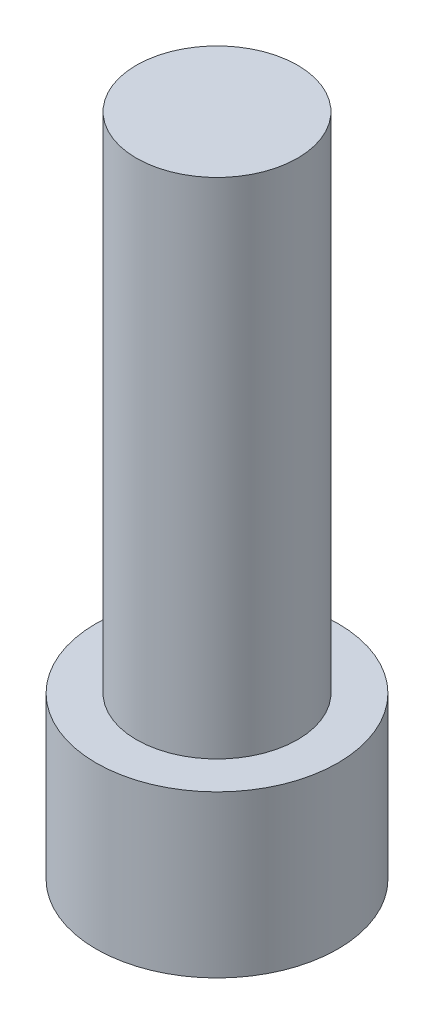
ISO-10303-21;
HEADER;
FILE_DESCRIPTION(('STEP AP214'),'2;1');
FILE_NAME('part.step','',(''),(''),'','','');
FILE_SCHEMA(('AUTOMOTIVE_DESIGN { 1 0 10303 214 1 1 1 1 }'));
ENDSEC;
DATA;
#1=APPLICATION_CONTEXT('core data for automotive mechanical design processes');
#2=APPLICATION_PROTOCOL_DEFINITION('international standard','automotive_design',2000,#1);
#3=PRODUCT_CONTEXT('',#1,'mechanical');
#4=PRODUCT('Part','Part','',(#3));
#5=PRODUCT_RELATED_PRODUCT_CATEGORY('part','',(#4));
#6=PRODUCT_DEFINITION_FORMATION('','',#4);
#7=PRODUCT_DEFINITION_CONTEXT('part definition',#1,'design');
#8=PRODUCT_DEFINITION('design','',#6,#7);
#9=PRODUCT_DEFINITION_SHAPE('','',#8);
#10=(LENGTH_UNIT() NAMED_UNIT(*) SI_UNIT(.MILLI.,.METRE.));
#11=(NAMED_UNIT(*) PLANE_ANGLE_UNIT() SI_UNIT($,.RADIAN.));
#12=(NAMED_UNIT(*) SI_UNIT($,.STERADIAN.) SOLID_ANGLE_UNIT());
#13=UNCERTAINTY_MEASURE_WITH_UNIT(LENGTH_MEASURE(1.E-05),#10,'distance_accuracy_value','');
#14=(GEOMETRIC_REPRESENTATION_CONTEXT(3) GLOBAL_UNCERTAINTY_ASSIGNED_CONTEXT((#13)) GLOBAL_UNIT_ASSIGNED_CONTEXT((#10,
#11,#12)) REPRESENTATION_CONTEXT('',''));
#15=CARTESIAN_POINT('',(0.,0.,0.));
#16=DIRECTION('',(0.,0.,1.));
#17=DIRECTION('',(1.,0.,0.));
#18=AXIS2_PLACEMENT_3D('',#15,#16,#17);
#19=CARTESIAN_POINT('',(0.,25.,0.));
#20=DIRECTION('',(0.,-1.,0.));
#21=DIRECTION('',(0.,0.,-1.));
#22=AXIS2_PLACEMENT_3D('',#19,#20,#21);
#23=CYLINDRICAL_SURFACE('',#22,4.);
#24=CARTESIAN_POINT('',(0.,25.,0.));
#25=DIRECTION('',(0.,1.,0.));
#26=DIRECTION('',(0.,0.,1.));
#27=AXIS2_PLACEMENT_3D('',#24,#25,#26);
#28=CIRCLE('',#27,4.);
#29=CARTESIAN_POINT('',(0.,25.,4.));
#30=VERTEX_POINT('',#29);
#31=EDGE_CURVE('E12',#30,#30,#28,.T.);
#32=ORIENTED_EDGE('',*,*,#31,.F.);
#33=EDGE_LOOP('',(#32));
#34=FACE_BOUND('',#33,.T.);
#35=CARTESIAN_POINT('',(0.,0.,0.));
#36=DIRECTION('',(0.,1.,0.));
#37=DIRECTION('',(0.,0.,1.));
#38=AXIS2_PLACEMENT_3D('',#35,#36,#37);
#39=CIRCLE('',#38,4.);
#40=CARTESIAN_POINT('',(0.,0.,4.));
#41=VERTEX_POINT('',#40);
#42=EDGE_CURVE('E66',#41,#41,#39,.T.);
#43=ORIENTED_EDGE('',*,*,#42,.T.);
#44=EDGE_LOOP('',(#43));
#45=FACE_BOUND('',#44,.T.);
#46=ADVANCED_FACE('F63',(#34,#45),#23,.T.);
#47=CARTESIAN_POINT('',(0.,25.,0.));
#48=DIRECTION('',(0.,1.,0.));
#49=DIRECTION('',(0.,0.,1.));
#50=AXIS2_PLACEMENT_3D('',#47,#48,#49);
#51=PLANE('',#50);
#52=ORIENTED_EDGE('',*,*,#31,.T.);
#53=EDGE_LOOP('',(#52));
#54=FACE_BOUND('',#53,.T.);
#55=ADVANCED_FACE('F202',(#54),#51,.T.);
#56=CARTESIAN_POINT('',(0.,0.,0.));
#57=DIRECTION('',(0.,-1.,0.));
#58=DIRECTION('',(0.,0.,-1.));
#59=AXIS2_PLACEMENT_3D('',#56,#57,#58);
#60=PLANE('',#59);
#61=ORIENTED_EDGE('',*,*,#42,.F.);
#62=EDGE_LOOP('',(#61));
#63=FACE_BOUND('',#62,.T.);
#64=CARTESIAN_POINT('',(0.,0.,0.));
#65=DIRECTION('',(0.,-1.,0.));
#66=DIRECTION('',(0.,0.,-1.));
#67=AXIS2_PLACEMENT_3D('',#64,#65,#66);
#68=CIRCLE('',#67,6.);
#69=CARTESIAN_POINT('',(0.,0.,-6.));
#70=VERTEX_POINT('',#69);
#71=EDGE_CURVE('E188',#70,#70,#68,.T.);
#72=ORIENTED_EDGE('',*,*,#71,.F.);
#73=EDGE_LOOP('',(#72));
#74=FACE_BOUND('',#73,.T.);
#75=ADVANCED_FACE('F198',(#63,#74),#60,.F.);
#76=CARTESIAN_POINT('',(0.,-2.,0.));
#77=DIRECTION('',(0.,1.,0.));
#78=DIRECTION('',(0.,0.,1.));
#79=AXIS2_PLACEMENT_3D('',#76,#77,#78);
#80=CYLINDRICAL_SURFACE('',#79,6.);
#81=ORIENTED_EDGE('',*,*,#71,.T.);
#82=EDGE_LOOP('',(#81));
#83=FACE_BOUND('',#82,.T.);
#84=CARTESIAN_POINT('',(0.,-8.,0.));
#85=DIRECTION('',(0.,-1.,0.));
#86=DIRECTION('',(0.,0.,-1.));
#87=AXIS2_PLACEMENT_3D('',#84,#85,#86);
#88=CIRCLE('',#87,6.);
#89=CARTESIAN_POINT('',(0.,-8.,-6.));
#90=VERTEX_POINT('',#89);
#91=EDGE_CURVE('E132',#90,#90,#88,.T.);
#92=ORIENTED_EDGE('',*,*,#91,.F.);
#93=EDGE_LOOP('',(#92));
#94=FACE_BOUND('',#93,.T.);
#95=ADVANCED_FACE('F201',(#83,#94),#80,.T.);
#96=CARTESIAN_POINT('',(0.,-8.,0.));
#97=DIRECTION('',(0.,-1.,0.));
#98=DIRECTION('',(0.,0.,-1.));
#99=AXIS2_PLACEMENT_3D('',#96,#97,#98);
#100=PLANE('',#99);
#101=ORIENTED_EDGE('',*,*,#91,.T.);
#102=EDGE_LOOP('',(#101));
#103=FACE_BOUND('',#102,.T.);
#104=DIRECTION('',(-0.5,0.,0.866025403784438));
#105=VECTOR('',#104,1.);
#106=CARTESIAN_POINT('',(4.61880215351701,-8.,0.));
#107=LINE('',#106,#105);
#108=CARTESIAN_POINT('',(4.61880215351701,-8.,0.));
#109=VERTEX_POINT('',#108);
#110=CARTESIAN_POINT('',(2.3094010767585,-8.,4.));
#111=VERTEX_POINT('',#110);
#112=EDGE_CURVE('E125',#109,#111,#107,.T.);
#113=ORIENTED_EDGE('',*,*,#112,.F.);
#114=DIRECTION('',(0.5,0.,0.866025403784438));
#115=VECTOR('',#114,1.);
#116=CARTESIAN_POINT('',(2.3094010767585,-8.,-4.));
#117=LINE('',#116,#115);
#118=CARTESIAN_POINT('',(2.3094010767585,-8.,-4.));
#119=VERTEX_POINT('',#118);
#120=EDGE_CURVE('E115',#119,#109,#117,.T.);
#121=ORIENTED_EDGE('',*,*,#120,.F.);
#122=DIRECTION('',(1.,0.,0.));
#123=VECTOR('',#122,1.);
#124=CARTESIAN_POINT('',(-2.3094010767585,-8.,-4.));
#125=LINE('',#124,#123);
#126=CARTESIAN_POINT('',(-2.3094010767585,-8.,-4.));
#127=VERTEX_POINT('',#126);
#128=EDGE_CURVE('E151',#127,#119,#125,.T.);
#129=ORIENTED_EDGE('',*,*,#128,.F.);
#130=DIRECTION('',(0.5,0.,-0.866025403784439));
#131=VECTOR('',#130,1.);
#132=CARTESIAN_POINT('',(-4.61880215351701,-8.,0.));
#133=LINE('',#132,#131);
#134=CARTESIAN_POINT('',(-4.61880215351701,-8.,0.));
#135=VERTEX_POINT('',#134);
#136=EDGE_CURVE('E147',#135,#127,#133,.T.);
#137=ORIENTED_EDGE('',*,*,#136,.F.);
#138=DIRECTION('',(-0.5,0.,-0.866025403784438));
#139=VECTOR('',#138,1.);
#140=CARTESIAN_POINT('',(-2.3094010767585,-8.,4.));
#141=LINE('',#140,#139);
#142=CARTESIAN_POINT('',(-2.3094010767585,-8.,4.));
#143=VERTEX_POINT('',#142);
#144=EDGE_CURVE('E142',#143,#135,#141,.T.);
#145=ORIENTED_EDGE('',*,*,#144,.F.);
#146=DIRECTION('',(-1.,0.,0.));
#147=VECTOR('',#146,1.);
#148=CARTESIAN_POINT('',(2.3094010767585,-8.,4.));
#149=LINE('',#148,#147);
#150=EDGE_CURVE('E138',#111,#143,#149,.T.);
#151=ORIENTED_EDGE('',*,*,#150,.F.);
#152=EDGE_LOOP('',(#113,#121,#129,#137,#145,#151));
#153=FACE_BOUND('',#152,.T.);
#154=ADVANCED_FACE('F136',(#103,#153),#100,.T.);
#155=CARTESIAN_POINT('',(2.3094010767585,-8.,-4.));
#156=DIRECTION('',(-0.866025403784439,0.,0.5));
#157=DIRECTION('',(0.5,0.,0.866025403784439));
#158=AXIS2_PLACEMENT_3D('',#155,#156,#157);
#159=PLANE('',#158);
#160=DIRECTION('',(0.5,0.,0.866025403784438));
#161=VECTOR('',#160,1.);
#162=CARTESIAN_POINT('',(2.3094010767585,-2.,-4.));
#163=LINE('',#162,#161);
#164=CARTESIAN_POINT('',(2.3094010767585,-2.,-4.));
#165=VERTEX_POINT('',#164);
#166=CARTESIAN_POINT('',(4.61880215351701,-2.,0.));
#167=VERTEX_POINT('',#166);
#168=EDGE_CURVE('E78',#165,#167,#163,.T.);
#169=ORIENTED_EDGE('',*,*,#168,.F.);
#170=DIRECTION('',(0.,1.,0.));
#171=VECTOR('',#170,1.);
#172=CARTESIAN_POINT('',(2.3094010767585,-8.,-4.));
#173=LINE('',#172,#171);
#174=EDGE_CURVE('E120',#119,#165,#173,.T.);
#175=ORIENTED_EDGE('',*,*,#174,.F.);
#176=ORIENTED_EDGE('',*,*,#120,.T.);
#177=DIRECTION('',(0.,1.,0.));
#178=VECTOR('',#177,1.);
#179=CARTESIAN_POINT('',(4.61880215351701,-8.,0.));
#180=LINE('',#179,#178);
#181=EDGE_CURVE('E118',#109,#167,#180,.T.);
#182=ORIENTED_EDGE('',*,*,#181,.T.);
#183=EDGE_LOOP('',(#169,#175,#176,#182));
#184=FACE_BOUND('',#183,.T.);
#185=ADVANCED_FACE('F117',(#184),#159,.T.);
#186=CARTESIAN_POINT('',(4.61880215351701,-8.,0.));
#187=DIRECTION('',(-0.866025403784438,0.,-0.5));
#188=DIRECTION('',(-0.5,0.,0.866025403784439));
#189=AXIS2_PLACEMENT_3D('',#186,#187,#188);
#190=PLANE('',#189);
#191=DIRECTION('',(-0.5,0.,0.866025403784438));
#192=VECTOR('',#191,1.);
#193=CARTESIAN_POINT('',(4.61880215351701,-2.,0.));
#194=LINE('',#193,#192);
#195=CARTESIAN_POINT('',(2.3094010767585,-2.,4.));
#196=VERTEX_POINT('',#195);
#197=EDGE_CURVE('E82',#167,#196,#194,.T.);
#198=ORIENTED_EDGE('',*,*,#197,.F.);
#199=ORIENTED_EDGE('',*,*,#181,.F.);
#200=ORIENTED_EDGE('',*,*,#112,.T.);
#201=DIRECTION('',(0.,1.,0.));
#202=VECTOR('',#201,1.);
#203=CARTESIAN_POINT('',(2.3094010767585,-8.,4.));
#204=LINE('',#203,#202);
#205=EDGE_CURVE('E133',#111,#196,#204,.T.);
#206=ORIENTED_EDGE('',*,*,#205,.T.);
#207=EDGE_LOOP('',(#198,#199,#200,#206));
#208=FACE_BOUND('',#207,.T.);
#209=ADVANCED_FACE('F129',(#208),#190,.T.);
#210=CARTESIAN_POINT('',(2.3094010767585,-8.,4.));
#211=DIRECTION('',(0.,0.,-1.));
#212=DIRECTION('',(-1.,0.,0.));
#213=AXIS2_PLACEMENT_3D('',#210,#211,#212);
#214=PLANE('',#213);
#215=DIRECTION('',(-1.,0.,0.));
#216=VECTOR('',#215,1.);
#217=CARTESIAN_POINT('',(2.3094010767585,-2.,4.));
#218=LINE('',#217,#216);
#219=CARTESIAN_POINT('',(-2.3094010767585,-2.,4.));
#220=VERTEX_POINT('',#219);
#221=EDGE_CURVE('E158',#196,#220,#218,.T.);
#222=ORIENTED_EDGE('',*,*,#221,.F.);
#223=ORIENTED_EDGE('',*,*,#205,.F.);
#224=ORIENTED_EDGE('',*,*,#150,.T.);
#225=DIRECTION('',(0.,1.,0.));
#226=VECTOR('',#225,1.);
#227=CARTESIAN_POINT('',(-2.3094010767585,-8.,4.));
#228=LINE('',#227,#226);
#229=EDGE_CURVE('E179',#143,#220,#228,.T.);
#230=ORIENTED_EDGE('',*,*,#229,.T.);
#231=EDGE_LOOP('',(#222,#223,#224,#230));
#232=FACE_BOUND('',#231,.T.);
#233=ADVANCED_FACE('F264',(#232),#214,.T.);
#234=CARTESIAN_POINT('',(-2.3094010767585,-8.,4.));
#235=DIRECTION('',(0.866025403784439,0.,-0.5));
#236=DIRECTION('',(-0.5,0.,-0.866025403784439));
#237=AXIS2_PLACEMENT_3D('',#234,#235,#236);
#238=PLANE('',#237);
#239=DIRECTION('',(-0.5,0.,-0.866025403784438));
#240=VECTOR('',#239,1.);
#241=CARTESIAN_POINT('',(-2.3094010767585,-2.,4.));
#242=LINE('',#241,#240);
#243=CARTESIAN_POINT('',(-4.61880215351701,-2.,0.));
#244=VERTEX_POINT('',#243);
#245=EDGE_CURVE('E161',#220,#244,#242,.T.);
#246=ORIENTED_EDGE('',*,*,#245,.F.);
#247=ORIENTED_EDGE('',*,*,#229,.F.);
#248=ORIENTED_EDGE('',*,*,#144,.T.);
#249=DIRECTION('',(0.,1.,0.));
#250=VECTOR('',#249,1.);
#251=CARTESIAN_POINT('',(-4.61880215351701,-8.,0.));
#252=LINE('',#251,#250);
#253=EDGE_CURVE('E175',#135,#244,#252,.T.);
#254=ORIENTED_EDGE('',*,*,#253,.T.);
#255=EDGE_LOOP('',(#246,#247,#248,#254));
#256=FACE_BOUND('',#255,.T.);
#257=ADVANCED_FACE('F274',(#256),#238,.T.);
#258=CARTESIAN_POINT('',(-4.61880215351701,-8.,0.));
#259=DIRECTION('',(0.866025403784439,0.,0.5));
#260=DIRECTION('',(0.5,0.,-0.866025403784439));
#261=AXIS2_PLACEMENT_3D('',#258,#259,#260);
#262=PLANE('',#261);
#263=DIRECTION('',(0.5,0.,-0.866025403784439));
#264=VECTOR('',#263,1.);
#265=CARTESIAN_POINT('',(-4.61880215351701,-2.,0.));
#266=LINE('',#265,#264);
#267=CARTESIAN_POINT('',(-2.3094010767585,-2.,-4.));
#268=VERTEX_POINT('',#267);
#269=EDGE_CURVE('E164',#244,#268,#266,.T.);
#270=ORIENTED_EDGE('',*,*,#269,.F.);
#271=ORIENTED_EDGE('',*,*,#253,.F.);
#272=ORIENTED_EDGE('',*,*,#136,.T.);
#273=DIRECTION('',(0.,1.,0.));
#274=VECTOR('',#273,1.);
#275=CARTESIAN_POINT('',(-2.3094010767585,-8.,-4.));
#276=LINE('',#275,#274);
#277=EDGE_CURVE('E171',#127,#268,#276,.T.);
#278=ORIENTED_EDGE('',*,*,#277,.T.);
#279=EDGE_LOOP('',(#270,#271,#272,#278));
#280=FACE_BOUND('',#279,.T.);
#281=ADVANCED_FACE('F285',(#280),#262,.T.);
#282=CARTESIAN_POINT('',(-2.3094010767585,-8.,-4.));
#283=DIRECTION('',(0.,0.,1.));
#284=DIRECTION('',(1.,0.,0.));
#285=AXIS2_PLACEMENT_3D('',#282,#283,#284);
#286=PLANE('',#285);
#287=DIRECTION('',(1.,0.,0.));
#288=VECTOR('',#287,1.);
#289=CARTESIAN_POINT('',(-2.3094010767585,-2.,-4.));
#290=LINE('',#289,#288);
#291=EDGE_CURVE('E126',#268,#165,#290,.T.);
#292=ORIENTED_EDGE('',*,*,#291,.F.);
#293=ORIENTED_EDGE('',*,*,#277,.F.);
#294=ORIENTED_EDGE('',*,*,#128,.T.);
#295=ORIENTED_EDGE('',*,*,#174,.T.);
#296=EDGE_LOOP('',(#292,#293,#294,#295));
#297=FACE_BOUND('',#296,.T.);
#298=ADVANCED_FACE('F296',(#297),#286,.T.);
#299=CARTESIAN_POINT('',(0.,-2.,0.));
#300=DIRECTION('',(0.,-1.,0.));
#301=DIRECTION('',(0.,0.,-1.));
#302=AXIS2_PLACEMENT_3D('',#299,#300,#301);
#303=PLANE('',#302);
#304=ORIENTED_EDGE('',*,*,#168,.T.);
#305=ORIENTED_EDGE('',*,*,#197,.T.);
#306=ORIENTED_EDGE('',*,*,#221,.T.);
#307=ORIENTED_EDGE('',*,*,#245,.T.);
#308=ORIENTED_EDGE('',*,*,#269,.T.);
#309=ORIENTED_EDGE('',*,*,#291,.T.);
#310=EDGE_LOOP('',(#304,#305,#306,#307,#308,#309));
#311=FACE_BOUND('',#310,.T.);
#312=ADVANCED_FACE('F307',(#311),#303,.T.);
#313=CLOSED_SHELL('',(#46,#55,#75,#95,#154,#185,#209,#233,#257,#281,#298,#312));
#314=MANIFOLD_SOLID_BREP('B2',#313);
#315=ADVANCED_BREP_SHAPE_REPRESENTATION('',(#18,#314),#14);
#316=SHAPE_DEFINITION_REPRESENTATION(#9,#315);
ENDSEC;
END-ISO-10303-21;
